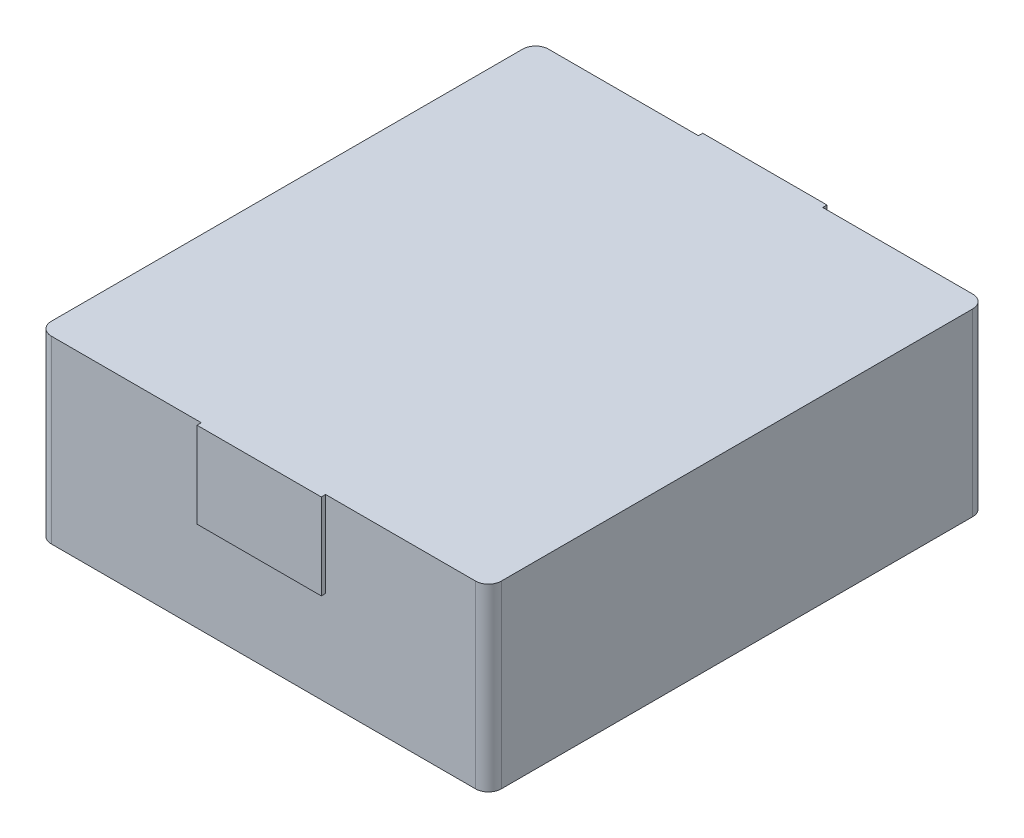
ISO-10303-21;
HEADER;
FILE_DESCRIPTION(('STEP AP214'),'2;1');
FILE_NAME('part.step','',(''),(''),'','','');
FILE_SCHEMA(('AUTOMOTIVE_DESIGN { 1 0 10303 214 1 1 1 1 }'));
ENDSEC;
DATA;
#1=APPLICATION_CONTEXT('core data for automotive mechanical design processes');
#2=APPLICATION_PROTOCOL_DEFINITION('international standard','automotive_design',2000,#1);
#3=PRODUCT_CONTEXT('',#1,'mechanical');
#4=PRODUCT('Part','Part','',(#3));
#5=PRODUCT_RELATED_PRODUCT_CATEGORY('part','',(#4));
#6=PRODUCT_DEFINITION_FORMATION('','',#4);
#7=PRODUCT_DEFINITION_CONTEXT('part definition',#1,'design');
#8=PRODUCT_DEFINITION('design','',#6,#7);
#9=PRODUCT_DEFINITION_SHAPE('','',#8);
#10=(LENGTH_UNIT() NAMED_UNIT(*) SI_UNIT(.MILLI.,.METRE.));
#11=(NAMED_UNIT(*) PLANE_ANGLE_UNIT() SI_UNIT($,.RADIAN.));
#12=(NAMED_UNIT(*) SI_UNIT($,.STERADIAN.) SOLID_ANGLE_UNIT());
#13=UNCERTAINTY_MEASURE_WITH_UNIT(LENGTH_MEASURE(1.E-05),#10,'distance_accuracy_value','');
#14=(GEOMETRIC_REPRESENTATION_CONTEXT(3) GLOBAL_UNCERTAINTY_ASSIGNED_CONTEXT((#13)) GLOBAL_UNIT_ASSIGNED_CONTEXT((#10,
#11,#12)) REPRESENTATION_CONTEXT('',''));
#15=CARTESIAN_POINT('',(0.,0.,0.));
#16=DIRECTION('',(0.,0.,1.));
#17=DIRECTION('',(1.,0.,0.));
#18=AXIS2_PLACEMENT_3D('',#15,#16,#17);
#19=CARTESIAN_POINT('',(13.1,5.75,-11.25));
#20=DIRECTION('',(0.,1.,0.));
#21=DIRECTION('',(0.,0.,-1.));
#22=AXIS2_PLACEMENT_3D('',#19,#20,#21);
#23=PLANE('',#22);
#24=DIRECTION('',(0.,0.,-1.));
#25=VECTOR('',#24,1.);
#26=CARTESIAN_POINT('',(10.2,5.75,-11.3));
#27=LINE('',#26,#25);
#28=CARTESIAN_POINT('',(10.2,5.75,-11.25));
#29=VERTEX_POINT('',#28);
#30=CARTESIAN_POINT('',(10.2,5.75,-11.35));
#31=VERTEX_POINT('',#30);
#32=EDGE_CURVE('E200',#29,#31,#27,.T.);
#33=ORIENTED_EDGE('',*,*,#32,.T.);
#34=DIRECTION('',(-1.,0.,0.));
#35=VECTOR('',#34,1.);
#36=CARTESIAN_POINT('',(11.65,5.75,-11.35));
#37=LINE('',#36,#35);
#38=CARTESIAN_POINT('',(13.1,5.75,-11.35));
#39=VERTEX_POINT('',#38);
#40=EDGE_CURVE('E152',#39,#31,#37,.T.);
#41=ORIENTED_EDGE('',*,*,#40,.F.);
#42=DIRECTION('',(0.,0.,1.));
#43=VECTOR('',#42,1.);
#44=CARTESIAN_POINT('',(13.1,5.75,-11.3));
#45=LINE('',#44,#43);
#46=CARTESIAN_POINT('',(13.1,5.75,-11.25));
#47=VERTEX_POINT('',#46);
#48=EDGE_CURVE('E199',#39,#47,#45,.T.);
#49=ORIENTED_EDGE('',*,*,#48,.T.);
#50=DIRECTION('',(-1.,0.,0.));
#51=VECTOR('',#50,1.);
#52=CARTESIAN_POINT('',(11.65,5.75,-11.25));
#53=LINE('',#52,#51);
#54=EDGE_CURVE('E240',#47,#29,#53,.T.);
#55=ORIENTED_EDGE('',*,*,#54,.T.);
#56=EDGE_LOOP('',(#33,#41,#49,#55));
#57=FACE_BOUND('',#56,.T.);
#58=ADVANCED_FACE('F17',(#57),#23,.F.);
#59=CARTESIAN_POINT('',(10.2,7.75,-11.35));
#60=DIRECTION('',(1.,0.,0.));
#61=DIRECTION('',(0.,0.,1.));
#62=AXIS2_PLACEMENT_3D('',#59,#60,#61);
#63=PLANE('',#62);
#64=ORIENTED_EDGE('',*,*,#32,.F.);
#65=DIRECTION('',(0.,1.,0.));
#66=VECTOR('',#65,1.);
#67=CARTESIAN_POINT('',(10.2,6.75,-11.25));
#68=LINE('',#67,#66);
#69=CARTESIAN_POINT('',(10.2,7.75,-11.25));
#70=VERTEX_POINT('',#69);
#71=EDGE_CURVE('E209',#29,#70,#68,.T.);
#72=ORIENTED_EDGE('',*,*,#71,.T.);
#73=DIRECTION('',(0.,0.,1.));
#74=VECTOR('',#73,1.);
#75=CARTESIAN_POINT('',(10.2,7.75,-11.3));
#76=LINE('',#75,#74);
#77=CARTESIAN_POINT('',(10.2,7.75,-11.35));
#78=VERTEX_POINT('',#77);
#79=EDGE_CURVE('E71',#78,#70,#76,.T.);
#80=ORIENTED_EDGE('',*,*,#79,.F.);
#81=DIRECTION('',(0.,1.,0.));
#82=VECTOR('',#81,1.);
#83=CARTESIAN_POINT('',(10.2,5.65,-11.35));
#84=LINE('',#83,#82);
#85=EDGE_CURVE('E150',#31,#78,#84,.T.);
#86=ORIENTED_EDGE('',*,*,#85,.F.);
#87=EDGE_LOOP('',(#64,#72,#80,#86));
#88=FACE_BOUND('',#87,.T.);
#89=ADVANCED_FACE('F327',(#88),#63,.F.);
#90=CARTESIAN_POINT('',(13.1,7.75,-11.25));
#91=DIRECTION('',(-1.,0.,0.));
#92=DIRECTION('',(0.,0.,-1.));
#93=AXIS2_PLACEMENT_3D('',#90,#91,#92);
#94=PLANE('',#93);
#95=ORIENTED_EDGE('',*,*,#48,.F.);
#96=DIRECTION('',(0.,-1.,0.));
#97=VECTOR('',#96,1.);
#98=CARTESIAN_POINT('',(13.1,5.65,-11.35));
#99=LINE('',#98,#97);
#100=CARTESIAN_POINT('',(13.1,7.75,-11.35));
#101=VERTEX_POINT('',#100);
#102=EDGE_CURVE('E146',#101,#39,#99,.T.);
#103=ORIENTED_EDGE('',*,*,#102,.F.);
#104=DIRECTION('',(0.,0.,-1.));
#105=VECTOR('',#104,1.);
#106=CARTESIAN_POINT('',(13.1,7.75,-11.3));
#107=LINE('',#106,#105);
#108=CARTESIAN_POINT('',(13.1,7.75,-11.25));
#109=VERTEX_POINT('',#108);
#110=EDGE_CURVE('E196',#109,#101,#107,.T.);
#111=ORIENTED_EDGE('',*,*,#110,.F.);
#112=DIRECTION('',(0.,-1.,0.));
#113=VECTOR('',#112,1.);
#114=CARTESIAN_POINT('',(13.1,6.75,-11.25));
#115=LINE('',#114,#113);
#116=EDGE_CURVE('E243',#109,#47,#115,.T.);
#117=ORIENTED_EDGE('',*,*,#116,.T.);
#118=EDGE_LOOP('',(#95,#103,#111,#117));
#119=FACE_BOUND('',#118,.T.);
#120=ADVANCED_FACE('F317',(#119),#94,.F.);
#121=CARTESIAN_POINT('',(6.7,3.55,-11.65));
#122=DIRECTION('',(0.,1.,0.));
#123=DIRECTION('',(0.,0.,1.));
#124=AXIS2_PLACEMENT_3D('',#121,#122,#123);
#125=CYLINDRICAL_SURFACE('',#124,0.3);
#126=CARTESIAN_POINT('',(6.7,3.55,-11.65));
#127=DIRECTION('',(0.,1.,0.));
#128=DIRECTION('',(0.,0.,1.));
#129=AXIS2_PLACEMENT_3D('',#126,#127,#128);
#130=CIRCLE('',#129,0.3);
#131=CARTESIAN_POINT('',(6.7,3.55,-11.35));
#132=VERTEX_POINT('',#131);
#133=CARTESIAN_POINT('',(6.4,3.55,-11.65));
#134=VERTEX_POINT('',#133);
#135=EDGE_CURVE('E248',#132,#134,#130,.F.);
#136=ORIENTED_EDGE('',*,*,#135,.F.);
#137=DIRECTION('',(0.,-1.,0.));
#138=VECTOR('',#137,1.);
#139=CARTESIAN_POINT('',(6.7,5.65,-11.35));
#140=LINE('',#139,#138);
#141=CARTESIAN_POINT('',(6.7,7.75,-11.35));
#142=VERTEX_POINT('',#141);
#143=EDGE_CURVE('E147',#142,#132,#140,.T.);
#144=ORIENTED_EDGE('',*,*,#143,.F.);
#145=CARTESIAN_POINT('',(6.7,7.75,-11.65));
#146=DIRECTION('',(0.,1.,0.));
#147=DIRECTION('',(0.,0.,1.));
#148=AXIS2_PLACEMENT_3D('',#145,#146,#147);
#149=CIRCLE('',#148,0.3);
#150=CARTESIAN_POINT('',(6.4,7.75,-11.65));
#151=VERTEX_POINT('',#150);
#152=EDGE_CURVE('E21',#151,#142,#149,.T.);
#153=ORIENTED_EDGE('',*,*,#152,.F.);
#154=DIRECTION('',(0.,1.,0.));
#155=VECTOR('',#154,1.);
#156=CARTESIAN_POINT('',(6.4,5.65,-11.65));
#157=LINE('',#156,#155);
#158=EDGE_CURVE('E141',#134,#151,#157,.T.);
#159=ORIENTED_EDGE('',*,*,#158,.F.);
#160=EDGE_LOOP('',(#136,#144,#153,#159));
#161=FACE_BOUND('',#160,.T.);
#162=ADVANCED_FACE('F314',(#161),#125,.T.);
#163=CARTESIAN_POINT('',(13.1,5.75,-23.05));
#164=DIRECTION('',(0.,-1.,0.));
#165=DIRECTION('',(0.,0.,1.));
#166=AXIS2_PLACEMENT_3D('',#163,#164,#165);
#167=PLANE('',#166);
#168=DIRECTION('',(-1.,0.,0.));
#169=VECTOR('',#168,1.);
#170=CARTESIAN_POINT('',(11.65,5.75,-23.05));
#171=LINE('',#170,#169);
#172=CARTESIAN_POINT('',(13.1,5.75,-23.05));
#173=VERTEX_POINT('',#172);
#174=CARTESIAN_POINT('',(10.2,5.75,-23.05));
#175=VERTEX_POINT('',#174);
#176=EDGE_CURVE('E221',#173,#175,#171,.T.);
#177=ORIENTED_EDGE('',*,*,#176,.F.);
#178=DIRECTION('',(0.,0.,-1.));
#179=VECTOR('',#178,1.);
#180=CARTESIAN_POINT('',(13.1,5.75,-23.));
#181=LINE('',#180,#179);
#182=CARTESIAN_POINT('',(13.1,5.75,-22.95));
#183=VERTEX_POINT('',#182);
#184=EDGE_CURVE('E188',#183,#173,#181,.T.);
#185=ORIENTED_EDGE('',*,*,#184,.F.);
#186=DIRECTION('',(1.,0.,0.));
#187=VECTOR('',#186,1.);
#188=CARTESIAN_POINT('',(11.65,5.75,-22.95));
#189=LINE('',#188,#187);
#190=CARTESIAN_POINT('',(10.2,5.75,-22.95));
#191=VERTEX_POINT('',#190);
#192=EDGE_CURVE('E178',#191,#183,#189,.T.);
#193=ORIENTED_EDGE('',*,*,#192,.F.);
#194=DIRECTION('',(0.,0.,1.));
#195=VECTOR('',#194,1.);
#196=CARTESIAN_POINT('',(10.2,5.75,-23.));
#197=LINE('',#196,#195);
#198=EDGE_CURVE('E170',#175,#191,#197,.T.);
#199=ORIENTED_EDGE('',*,*,#198,.F.);
#200=EDGE_LOOP('',(#177,#185,#193,#199));
#201=FACE_BOUND('',#200,.T.);
#202=ADVANCED_FACE('F316',(#201),#167,.T.);
#203=CARTESIAN_POINT('',(13.1,7.75,-23.05));
#204=DIRECTION('',(1.,0.,0.));
#205=DIRECTION('',(0.,0.,1.));
#206=AXIS2_PLACEMENT_3D('',#203,#204,#205);
#207=PLANE('',#206);
#208=DIRECTION('',(0.,-1.,0.));
#209=VECTOR('',#208,1.);
#210=CARTESIAN_POINT('',(13.1,6.75,-23.05));
#211=LINE('',#210,#209);
#212=CARTESIAN_POINT('',(13.1,7.75,-23.05));
#213=VERTEX_POINT('',#212);
#214=EDGE_CURVE('E143',#213,#173,#211,.T.);
#215=ORIENTED_EDGE('',*,*,#214,.F.);
#216=DIRECTION('',(0.,0.,1.));
#217=VECTOR('',#216,1.);
#218=CARTESIAN_POINT('',(13.1,7.75,-23.));
#219=LINE('',#218,#217);
#220=CARTESIAN_POINT('',(13.1,7.75,-22.95));
#221=VERTEX_POINT('',#220);
#222=EDGE_CURVE('E185',#213,#221,#219,.T.);
#223=ORIENTED_EDGE('',*,*,#222,.T.);
#224=DIRECTION('',(0.,1.,0.));
#225=VECTOR('',#224,1.);
#226=CARTESIAN_POINT('',(13.1,5.65,-22.95));
#227=LINE('',#226,#225);
#228=EDGE_CURVE('E181',#183,#221,#227,.T.);
#229=ORIENTED_EDGE('',*,*,#228,.F.);
#230=ORIENTED_EDGE('',*,*,#184,.T.);
#231=EDGE_LOOP('',(#215,#223,#229,#230));
#232=FACE_BOUND('',#231,.T.);
#233=ADVANCED_FACE('F324',(#232),#207,.T.);
#234=CARTESIAN_POINT('',(6.7,3.55,-22.65));
#235=DIRECTION('',(0.,1.,0.));
#236=DIRECTION('',(-1.,0.,0.));
#237=AXIS2_PLACEMENT_3D('',#234,#235,#236);
#238=CYLINDRICAL_SURFACE('',#237,0.299999999999995);
#239=CARTESIAN_POINT('',(6.7,3.55,-22.65));
#240=DIRECTION('',(0.,1.,0.));
#241=DIRECTION('',(-1.,0.,0.));
#242=AXIS2_PLACEMENT_3D('',#239,#240,#241);
#243=CIRCLE('',#242,0.299999999999995);
#244=CARTESIAN_POINT('',(6.4,3.55,-22.65));
#245=VERTEX_POINT('',#244);
#246=CARTESIAN_POINT('',(6.7,3.55,-22.95));
#247=VERTEX_POINT('',#246);
#248=EDGE_CURVE('E106',#245,#247,#243,.F.);
#249=ORIENTED_EDGE('',*,*,#248,.F.);
#250=DIRECTION('',(0.,-1.,0.));
#251=VECTOR('',#250,1.);
#252=CARTESIAN_POINT('',(6.4,5.65,-22.65));
#253=LINE('',#252,#251);
#254=CARTESIAN_POINT('',(6.4,7.75,-22.65));
#255=VERTEX_POINT('',#254);
#256=EDGE_CURVE('E144',#255,#245,#253,.T.);
#257=ORIENTED_EDGE('',*,*,#256,.F.);
#258=CARTESIAN_POINT('',(6.7,7.75,-22.65));
#259=DIRECTION('',(0.,1.,0.));
#260=DIRECTION('',(-1.,0.,0.));
#261=AXIS2_PLACEMENT_3D('',#258,#259,#260);
#262=CIRCLE('',#261,0.299999999999995);
#263=CARTESIAN_POINT('',(6.7,7.75,-22.95));
#264=VERTEX_POINT('',#263);
#265=EDGE_CURVE('E129',#264,#255,#262,.T.);
#266=ORIENTED_EDGE('',*,*,#265,.F.);
#267=DIRECTION('',(0.,1.,0.));
#268=VECTOR('',#267,1.);
#269=CARTESIAN_POINT('',(6.7,5.65,-22.95));
#270=LINE('',#269,#268);
#271=EDGE_CURVE('E121',#247,#264,#270,.T.);
#272=ORIENTED_EDGE('',*,*,#271,.F.);
#273=EDGE_LOOP('',(#249,#257,#266,#272));
#274=FACE_BOUND('',#273,.T.);
#275=ADVANCED_FACE('F128',(#274),#238,.T.);
#276=CARTESIAN_POINT('',(10.2,7.75,-22.95));
#277=DIRECTION('',(-1.,0.,0.));
#278=DIRECTION('',(0.,0.,-1.));
#279=AXIS2_PLACEMENT_3D('',#276,#277,#278);
#280=PLANE('',#279);
#281=DIRECTION('',(0.,1.,0.));
#282=VECTOR('',#281,1.);
#283=CARTESIAN_POINT('',(10.2,6.75,-23.05));
#284=LINE('',#283,#282);
#285=CARTESIAN_POINT('',(10.2,7.75,-23.05));
#286=VERTEX_POINT('',#285);
#287=EDGE_CURVE('E182',#175,#286,#284,.T.);
#288=ORIENTED_EDGE('',*,*,#287,.F.);
#289=ORIENTED_EDGE('',*,*,#198,.T.);
#290=DIRECTION('',(0.,-1.,0.));
#291=VECTOR('',#290,1.);
#292=CARTESIAN_POINT('',(10.2,5.65,-22.95));
#293=LINE('',#292,#291);
#294=CARTESIAN_POINT('',(10.2,7.75,-22.95));
#295=VERTEX_POINT('',#294);
#296=EDGE_CURVE('E130',#295,#191,#293,.T.);
#297=ORIENTED_EDGE('',*,*,#296,.F.);
#298=DIRECTION('',(0.,0.,-1.));
#299=VECTOR('',#298,1.);
#300=CARTESIAN_POINT('',(10.2,7.75,-23.));
#301=LINE('',#300,#299);
#302=EDGE_CURVE('E167',#295,#286,#301,.T.);
#303=ORIENTED_EDGE('',*,*,#302,.T.);
#304=EDGE_LOOP('',(#288,#289,#297,#303));
#305=FACE_BOUND('',#304,.T.);
#306=ADVANCED_FACE('F355',(#305),#280,.T.);
#307=CARTESIAN_POINT('',(16.6,3.55,-22.65));
#308=DIRECTION('',(0.,1.,0.));
#309=DIRECTION('',(0.,0.,1.));
#310=AXIS2_PLACEMENT_3D('',#307,#308,#309);
#311=CYLINDRICAL_SURFACE('',#310,0.300000000000002);
#312=CARTESIAN_POINT('',(16.6,3.55,-22.65));
#313=DIRECTION('',(0.,1.,0.));
#314=DIRECTION('',(0.,0.,1.));
#315=AXIS2_PLACEMENT_3D('',#312,#313,#314);
#316=CIRCLE('',#315,0.300000000000002);
#317=CARTESIAN_POINT('',(16.6,3.55,-22.95));
#318=VERTEX_POINT('',#317);
#319=CARTESIAN_POINT('',(16.9,3.55,-22.65));
#320=VERTEX_POINT('',#319);
#321=EDGE_CURVE('E115',#318,#320,#316,.F.);
#322=ORIENTED_EDGE('',*,*,#321,.F.);
#323=DIRECTION('',(0.,-1.,0.));
#324=VECTOR('',#323,1.);
#325=CARTESIAN_POINT('',(16.6,5.65,-22.95));
#326=LINE('',#325,#324);
#327=CARTESIAN_POINT('',(16.6,7.75,-22.95));
#328=VERTEX_POINT('',#327);
#329=EDGE_CURVE('E125',#328,#318,#326,.T.);
#330=ORIENTED_EDGE('',*,*,#329,.F.);
#331=CARTESIAN_POINT('',(16.6,7.75,-22.65));
#332=DIRECTION('',(0.,1.,0.));
#333=DIRECTION('',(0.,0.,1.));
#334=AXIS2_PLACEMENT_3D('',#331,#332,#333);
#335=CIRCLE('',#334,0.300000000000002);
#336=CARTESIAN_POINT('',(16.9,7.75,-22.65));
#337=VERTEX_POINT('',#336);
#338=EDGE_CURVE('E175',#337,#328,#335,.T.);
#339=ORIENTED_EDGE('',*,*,#338,.F.);
#340=DIRECTION('',(0.,1.,0.));
#341=VECTOR('',#340,1.);
#342=CARTESIAN_POINT('',(16.9,5.65,-22.65));
#343=LINE('',#342,#341);
#344=EDGE_CURVE('E133',#320,#337,#343,.T.);
#345=ORIENTED_EDGE('',*,*,#344,.F.);
#346=EDGE_LOOP('',(#322,#330,#339,#345));
#347=FACE_BOUND('',#346,.T.);
#348=ADVANCED_FACE('F302',(#347),#311,.T.);
#349=CARTESIAN_POINT('',(16.6,3.55,-11.65));
#350=DIRECTION('',(0.,1.,0.));
#351=DIRECTION('',(-1.,0.,0.));
#352=AXIS2_PLACEMENT_3D('',#349,#350,#351);
#353=CYLINDRICAL_SURFACE('',#352,0.3);
#354=CARTESIAN_POINT('',(16.6,3.55,-11.65));
#355=DIRECTION('',(0.,1.,0.));
#356=DIRECTION('',(-1.,0.,0.));
#357=AXIS2_PLACEMENT_3D('',#354,#355,#356);
#358=CIRCLE('',#357,0.3);
#359=CARTESIAN_POINT('',(16.9,3.55,-11.65));
#360=VERTEX_POINT('',#359);
#361=CARTESIAN_POINT('',(16.6,3.55,-11.35));
#362=VERTEX_POINT('',#361);
#363=EDGE_CURVE('E261',#360,#362,#358,.F.);
#364=ORIENTED_EDGE('',*,*,#363,.F.);
#365=DIRECTION('',(0.,-1.,0.));
#366=VECTOR('',#365,1.);
#367=CARTESIAN_POINT('',(16.9,5.65,-11.65));
#368=LINE('',#367,#366);
#369=CARTESIAN_POINT('',(16.9,7.75,-11.65));
#370=VERTEX_POINT('',#369);
#371=EDGE_CURVE('E166',#370,#360,#368,.T.);
#372=ORIENTED_EDGE('',*,*,#371,.F.);
#373=CARTESIAN_POINT('',(16.6,7.75,-11.65));
#374=DIRECTION('',(0.,1.,0.));
#375=DIRECTION('',(-1.,0.,0.));
#376=AXIS2_PLACEMENT_3D('',#373,#374,#375);
#377=CIRCLE('',#376,0.3);
#378=CARTESIAN_POINT('',(16.6,7.75,-11.35));
#379=VERTEX_POINT('',#378);
#380=EDGE_CURVE('E36',#379,#370,#377,.T.);
#381=ORIENTED_EDGE('',*,*,#380,.F.);
#382=DIRECTION('',(0.,1.,0.));
#383=VECTOR('',#382,1.);
#384=CARTESIAN_POINT('',(16.6,5.65,-11.35));
#385=LINE('',#384,#383);
#386=EDGE_CURVE('E155',#362,#379,#385,.T.);
#387=ORIENTED_EDGE('',*,*,#386,.F.);
#388=EDGE_LOOP('',(#364,#372,#381,#387));
#389=FACE_BOUND('',#388,.T.);
#390=ADVANCED_FACE('F309',(#389),#353,.T.);
#391=CARTESIAN_POINT('',(17.00605,3.55,-23.066));
#392=DIRECTION('',(0.,-1.,0.));
#393=DIRECTION('',(0.,0.,1.));
#394=AXIS2_PLACEMENT_3D('',#391,#392,#393);
#395=PLANE('',#394);
#396=ORIENTED_EDGE('',*,*,#135,.T.);
#397=DIRECTION('',(0.,0.,1.));
#398=VECTOR('',#397,1.);
#399=CARTESIAN_POINT('',(6.4,3.55,-17.15));
#400=LINE('',#399,#398);
#401=EDGE_CURVE('E111',#245,#134,#400,.T.);
#402=ORIENTED_EDGE('',*,*,#401,.F.);
#403=ORIENTED_EDGE('',*,*,#248,.T.);
#404=DIRECTION('',(-1.,0.,0.));
#405=VECTOR('',#404,1.);
#406=CARTESIAN_POINT('',(11.65,3.55,-22.95));
#407=LINE('',#406,#405);
#408=EDGE_CURVE('E109',#318,#247,#407,.T.);
#409=ORIENTED_EDGE('',*,*,#408,.F.);
#410=ORIENTED_EDGE('',*,*,#321,.T.);
#411=DIRECTION('',(0.,0.,-1.));
#412=VECTOR('',#411,1.);
#413=CARTESIAN_POINT('',(16.9,3.55,-17.15));
#414=LINE('',#413,#412);
#415=EDGE_CURVE('E162',#360,#320,#414,.T.);
#416=ORIENTED_EDGE('',*,*,#415,.F.);
#417=ORIENTED_EDGE('',*,*,#363,.T.);
#418=DIRECTION('',(1.,0.,0.));
#419=VECTOR('',#418,1.);
#420=CARTESIAN_POINT('',(11.65,3.55,-11.35));
#421=LINE('',#420,#419);
#422=EDGE_CURVE('E149',#132,#362,#421,.T.);
#423=ORIENTED_EDGE('',*,*,#422,.F.);
#424=EDGE_LOOP('',(#396,#402,#403,#409,#410,#416,#417,#423));
#425=FACE_BOUND('',#424,.T.);
#426=ADVANCED_FACE('F108',(#425),#395,.T.);
#427=CARTESIAN_POINT('',(10.2,7.75,-11.25));
#428=DIRECTION('',(0.,0.,-1.));
#429=DIRECTION('',(1.,0.,0.));
#430=AXIS2_PLACEMENT_3D('',#427,#428,#429);
#431=PLANE('',#430);
#432=ORIENTED_EDGE('',*,*,#54,.F.);
#433=ORIENTED_EDGE('',*,*,#116,.F.);
#434=DIRECTION('',(-1.,0.,0.));
#435=VECTOR('',#434,1.);
#436=CARTESIAN_POINT('',(11.650525,7.75,-11.25));
#437=LINE('',#436,#435);
#438=EDGE_CURVE('E251',#109,#70,#437,.T.);
#439=ORIENTED_EDGE('',*,*,#438,.T.);
#440=ORIENTED_EDGE('',*,*,#71,.F.);
#441=EDGE_LOOP('',(#432,#433,#439,#440));
#442=FACE_BOUND('',#441,.T.);
#443=ADVANCED_FACE('F349',(#442),#431,.F.);
#444=CARTESIAN_POINT('',(16.6,7.75,-11.35));
#445=DIRECTION('',(0.,0.,1.));
#446=DIRECTION('',(-1.,0.,0.));
#447=AXIS2_PLACEMENT_3D('',#444,#445,#446);
#448=PLANE('',#447);
#449=DIRECTION('',(-1.,0.,0.));
#450=VECTOR('',#449,1.);
#451=CARTESIAN_POINT('',(11.650525,7.75,-11.35));
#452=LINE('',#451,#450);
#453=EDGE_CURVE('E165',#379,#101,#452,.T.);
#454=ORIENTED_EDGE('',*,*,#453,.T.);
#455=ORIENTED_EDGE('',*,*,#102,.T.);
#456=ORIENTED_EDGE('',*,*,#40,.T.);
#457=ORIENTED_EDGE('',*,*,#85,.T.);
#458=DIRECTION('',(-1.,0.,0.));
#459=VECTOR('',#458,1.);
#460=CARTESIAN_POINT('',(11.650525,7.75,-11.35));
#461=LINE('',#460,#459);
#462=EDGE_CURVE('E254',#78,#142,#461,.T.);
#463=ORIENTED_EDGE('',*,*,#462,.T.);
#464=ORIENTED_EDGE('',*,*,#143,.T.);
#465=ORIENTED_EDGE('',*,*,#422,.T.);
#466=ORIENTED_EDGE('',*,*,#386,.T.);
#467=EDGE_LOOP('',(#454,#455,#456,#457,#463,#464,#465,#466));
#468=FACE_BOUND('',#467,.T.);
#469=ADVANCED_FACE('F312',(#468),#448,.T.);
#470=CARTESIAN_POINT('',(6.4,7.75,-11.65));
#471=DIRECTION('',(-1.,0.,0.));
#472=DIRECTION('',(0.,0.,-1.));
#473=AXIS2_PLACEMENT_3D('',#470,#471,#472);
#474=PLANE('',#473);
#475=ORIENTED_EDGE('',*,*,#158,.T.);
#476=DIRECTION('',(0.,0.,-1.));
#477=VECTOR('',#476,1.);
#478=CARTESIAN_POINT('',(6.4,7.75,-17.15));
#479=LINE('',#478,#477);
#480=EDGE_CURVE('E266',#151,#255,#479,.T.);
#481=ORIENTED_EDGE('',*,*,#480,.T.);
#482=ORIENTED_EDGE('',*,*,#256,.T.);
#483=ORIENTED_EDGE('',*,*,#401,.T.);
#484=EDGE_LOOP('',(#475,#481,#482,#483));
#485=FACE_BOUND('',#484,.T.);
#486=ADVANCED_FACE('F269',(#485),#474,.T.);
#487=CARTESIAN_POINT('',(10.2,7.75,-23.05));
#488=DIRECTION('',(0.,0.,-1.));
#489=DIRECTION('',(1.,0.,0.));
#490=AXIS2_PLACEMENT_3D('',#487,#488,#489);
#491=PLANE('',#490);
#492=ORIENTED_EDGE('',*,*,#176,.T.);
#493=ORIENTED_EDGE('',*,*,#287,.T.);
#494=DIRECTION('',(1.,0.,0.));
#495=VECTOR('',#494,1.);
#496=CARTESIAN_POINT('',(11.650525,7.75,-23.05));
#497=LINE('',#496,#495);
#498=EDGE_CURVE('E230',#286,#213,#497,.T.);
#499=ORIENTED_EDGE('',*,*,#498,.T.);
#500=ORIENTED_EDGE('',*,*,#214,.T.);
#501=EDGE_LOOP('',(#492,#493,#499,#500));
#502=FACE_BOUND('',#501,.T.);
#503=ADVANCED_FACE('F339',(#502),#491,.T.);
#504=CARTESIAN_POINT('',(6.7,7.75,-22.95));
#505=DIRECTION('',(0.,0.,-1.));
#506=DIRECTION('',(1.,0.,0.));
#507=AXIS2_PLACEMENT_3D('',#504,#505,#506);
#508=PLANE('',#507);
#509=DIRECTION('',(1.,0.,0.));
#510=VECTOR('',#509,1.);
#511=CARTESIAN_POINT('',(11.650525,7.75,-22.95));
#512=LINE('',#511,#510);
#513=EDGE_CURVE('E233',#264,#295,#512,.T.);
#514=ORIENTED_EDGE('',*,*,#513,.T.);
#515=ORIENTED_EDGE('',*,*,#296,.T.);
#516=ORIENTED_EDGE('',*,*,#192,.T.);
#517=ORIENTED_EDGE('',*,*,#228,.T.);
#518=DIRECTION('',(1.,0.,0.));
#519=VECTOR('',#518,1.);
#520=CARTESIAN_POINT('',(11.650525,7.75,-22.95));
#521=LINE('',#520,#519);
#522=EDGE_CURVE('E27',#221,#328,#521,.T.);
#523=ORIENTED_EDGE('',*,*,#522,.T.);
#524=ORIENTED_EDGE('',*,*,#329,.T.);
#525=ORIENTED_EDGE('',*,*,#408,.T.);
#526=ORIENTED_EDGE('',*,*,#271,.T.);
#527=EDGE_LOOP('',(#514,#515,#516,#517,#523,#524,#525,#526));
#528=FACE_BOUND('',#527,.T.);
#529=ADVANCED_FACE('F120',(#528),#508,.T.);
#530=CARTESIAN_POINT('',(16.9,7.75,-22.65));
#531=DIRECTION('',(1.,0.,0.));
#532=DIRECTION('',(0.,0.,1.));
#533=AXIS2_PLACEMENT_3D('',#530,#531,#532);
#534=PLANE('',#533);
#535=ORIENTED_EDGE('',*,*,#371,.T.);
#536=ORIENTED_EDGE('',*,*,#415,.T.);
#537=ORIENTED_EDGE('',*,*,#344,.T.);
#538=DIRECTION('',(0.,0.,1.));
#539=VECTOR('',#538,1.);
#540=CARTESIAN_POINT('',(16.9,7.75,-17.15));
#541=LINE('',#540,#539);
#542=EDGE_CURVE('E11',#337,#370,#541,.T.);
#543=ORIENTED_EDGE('',*,*,#542,.T.);
#544=EDGE_LOOP('',(#535,#536,#537,#543));
#545=FACE_BOUND('',#544,.T.);
#546=ADVANCED_FACE('F305',(#545),#534,.T.);
#547=CARTESIAN_POINT('',(17.00605,7.75,-23.05));
#548=DIRECTION('',(0.,-1.,0.));
#549=DIRECTION('',(0.,0.,1.));
#550=AXIS2_PLACEMENT_3D('',#547,#548,#549);
#551=PLANE('',#550);
#552=ORIENTED_EDGE('',*,*,#542,.F.);
#553=ORIENTED_EDGE('',*,*,#338,.T.);
#554=ORIENTED_EDGE('',*,*,#522,.F.);
#555=ORIENTED_EDGE('',*,*,#222,.F.);
#556=ORIENTED_EDGE('',*,*,#498,.F.);
#557=ORIENTED_EDGE('',*,*,#302,.F.);
#558=ORIENTED_EDGE('',*,*,#513,.F.);
#559=ORIENTED_EDGE('',*,*,#265,.T.);
#560=ORIENTED_EDGE('',*,*,#480,.F.);
#561=ORIENTED_EDGE('',*,*,#152,.T.);
#562=ORIENTED_EDGE('',*,*,#462,.F.);
#563=ORIENTED_EDGE('',*,*,#79,.T.);
#564=ORIENTED_EDGE('',*,*,#438,.F.);
#565=ORIENTED_EDGE('',*,*,#110,.T.);
#566=ORIENTED_EDGE('',*,*,#453,.F.);
#567=ORIENTED_EDGE('',*,*,#380,.T.);
#568=EDGE_LOOP('',(#552,#553,#554,#555,#556,#557,#558,#559,#560,#561,#562,#563,#564,#565,#566,#567));
#569=FACE_BOUND('',#568,.T.);
#570=ADVANCED_FACE('F19',(#569),#551,.F.);
#571=CLOSED_SHELL('',(#58,#89,#120,#162,#202,#233,#275,#306,#348,#390,#426,#443,#469,#486,#503,
#529,#546,#570));
#572=MANIFOLD_SOLID_BREP('B1',#571);
#573=ADVANCED_BREP_SHAPE_REPRESENTATION('',(#18,#572),#14);
#574=SHAPE_DEFINITION_REPRESENTATION(#9,#573);
ENDSEC;
END-ISO-10303-21;
